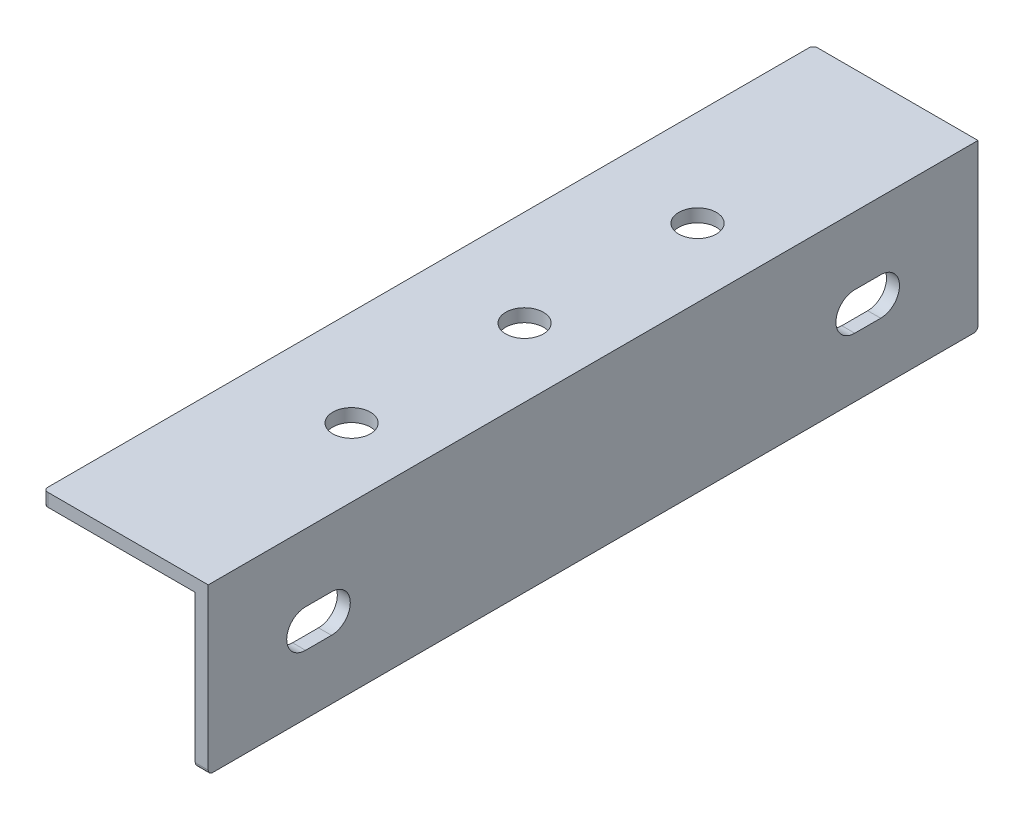
ISO-10303-21;
HEADER;
FILE_DESCRIPTION(('STEP AP214'),'2;1');
FILE_NAME('part.step','',(''),(''),'','','');
FILE_SCHEMA(('AUTOMOTIVE_DESIGN { 1 0 10303 214 1 1 1 1 }'));
ENDSEC;
DATA;
#1=APPLICATION_CONTEXT('core data for automotive mechanical design processes');
#2=APPLICATION_PROTOCOL_DEFINITION('international standard','automotive_design',2000,#1);
#3=PRODUCT_CONTEXT('',#1,'mechanical');
#4=PRODUCT('Part','Part','',(#3));
#5=PRODUCT_RELATED_PRODUCT_CATEGORY('part','',(#4));
#6=PRODUCT_DEFINITION_FORMATION('','',#4);
#7=PRODUCT_DEFINITION_CONTEXT('part definition',#1,'design');
#8=PRODUCT_DEFINITION('design','',#6,#7);
#9=PRODUCT_DEFINITION_SHAPE('','',#8);
#10=(LENGTH_UNIT() NAMED_UNIT(*) SI_UNIT(.MILLI.,.METRE.));
#11=(NAMED_UNIT(*) PLANE_ANGLE_UNIT() SI_UNIT($,.RADIAN.));
#12=(NAMED_UNIT(*) SI_UNIT($,.STERADIAN.) SOLID_ANGLE_UNIT());
#13=UNCERTAINTY_MEASURE_WITH_UNIT(LENGTH_MEASURE(1.E-05),#10,'distance_accuracy_value','');
#14=(GEOMETRIC_REPRESENTATION_CONTEXT(3) GLOBAL_UNCERTAINTY_ASSIGNED_CONTEXT((#13)) GLOBAL_UNIT_ASSIGNED_CONTEXT((#10,
#11,#12)) REPRESENTATION_CONTEXT('',''));
#15=CARTESIAN_POINT('',(0.,0.,0.));
#16=DIRECTION('',(0.,0.,1.));
#17=DIRECTION('',(1.,0.,0.));
#18=AXIS2_PLACEMENT_3D('',#15,#16,#17);
#19=CARTESIAN_POINT('',(9.662479411371,-18.55,-44.));
#20=DIRECTION('',(-1.,0.,0.));
#21=DIRECTION('',(0.,0.,1.));
#22=AXIS2_PLACEMENT_3D('',#19,#20,#21);
#23=CYLINDRICAL_SURFACE('',#22,0.5);
#24=CARTESIAN_POINT('',(8.025,-18.55,-44.));
#25=DIRECTION('',(-1.,0.,0.));
#26=DIRECTION('',(0.,0.,1.));
#27=AXIS2_PLACEMENT_3D('',#24,#25,#26);
#28=CIRCLE('',#27,0.5);
#29=CARTESIAN_POINT('',(8.025,-18.55,-44.5));
#30=VERTEX_POINT('',#29);
#31=CARTESIAN_POINT('',(8.025,-19.05,-44.));
#32=VERTEX_POINT('',#31);
#33=EDGE_CURVE('E224',#30,#32,#28,.T.);
#34=ORIENTED_EDGE('',*,*,#33,.F.);
#35=DIRECTION('',(-1.,0.,0.));
#36=VECTOR('',#35,1.);
#37=CARTESIAN_POINT('',(-9.525,-18.55,-44.5));
#38=LINE('',#37,#36);
#39=CARTESIAN_POINT('',(9.525,-18.55,-44.5));
#40=VERTEX_POINT('',#39);
#41=EDGE_CURVE('E177',#40,#30,#38,.T.);
#42=ORIENTED_EDGE('',*,*,#41,.F.);
#43=CARTESIAN_POINT('',(9.525,-18.55,-44.));
#44=DIRECTION('',(-1.,0.,0.));
#45=DIRECTION('',(0.,0.,1.));
#46=AXIS2_PLACEMENT_3D('',#43,#44,#45);
#47=CIRCLE('',#46,0.5);
#48=CARTESIAN_POINT('',(9.525,-19.05,-44.));
#49=VERTEX_POINT('',#48);
#50=EDGE_CURVE('E19',#40,#49,#47,.T.);
#51=ORIENTED_EDGE('',*,*,#50,.T.);
#52=DIRECTION('',(1.,0.,0.));
#53=VECTOR('',#52,1.);
#54=CARTESIAN_POINT('',(8.025,-19.05,-44.));
#55=LINE('',#54,#53);
#56=EDGE_CURVE('E240',#32,#49,#55,.T.);
#57=ORIENTED_EDGE('',*,*,#56,.F.);
#58=EDGE_LOOP('',(#34,#42,#51,#57));
#59=FACE_BOUND('',#58,.T.);
#60=ADVANCED_FACE('F16',(#59),#23,.T.);
#61=CARTESIAN_POINT('',(-9.025,-1.714615615478,-44.));
#62=DIRECTION('',(0.,1.,0.));
#63=DIRECTION('',(0.,0.,1.));
#64=AXIS2_PLACEMENT_3D('',#61,#62,#63);
#65=CYLINDRICAL_SURFACE('',#64,0.5);
#66=CARTESIAN_POINT('',(-9.025,0.,-44.));
#67=DIRECTION('',(0.,1.,0.));
#68=DIRECTION('',(0.,0.,1.));
#69=AXIS2_PLACEMENT_3D('',#66,#67,#68);
#70=CIRCLE('',#69,0.5);
#71=CARTESIAN_POINT('',(-9.525,0.,-44.));
#72=VERTEX_POINT('',#71);
#73=CARTESIAN_POINT('',(-9.025,0.,-44.5));
#74=VERTEX_POINT('',#73);
#75=EDGE_CURVE('E241',#72,#74,#70,.F.);
#76=ORIENTED_EDGE('',*,*,#75,.T.);
#77=DIRECTION('',(0.,1.,0.));
#78=VECTOR('',#77,1.);
#79=CARTESIAN_POINT('',(-9.025,0.,-44.5));
#80=LINE('',#79,#78);
#81=CARTESIAN_POINT('',(-9.025,-1.5,-44.5));
#82=VERTEX_POINT('',#81);
#83=EDGE_CURVE('E164',#82,#74,#80,.T.);
#84=ORIENTED_EDGE('',*,*,#83,.F.);
#85=CARTESIAN_POINT('',(-9.025,-1.5,-44.));
#86=DIRECTION('',(0.,1.,0.));
#87=DIRECTION('',(0.,0.,1.));
#88=AXIS2_PLACEMENT_3D('',#85,#86,#87);
#89=CIRCLE('',#88,0.5);
#90=CARTESIAN_POINT('',(-9.525,-1.5,-44.));
#91=VERTEX_POINT('',#90);
#92=EDGE_CURVE('E161',#91,#82,#89,.F.);
#93=ORIENTED_EDGE('',*,*,#92,.F.);
#94=DIRECTION('',(0.,1.,0.));
#95=VECTOR('',#94,1.);
#96=CARTESIAN_POINT('',(-9.525,0.,-44.));
#97=LINE('',#96,#95);
#98=EDGE_CURVE('E148',#72,#91,#97,.F.);
#99=ORIENTED_EDGE('',*,*,#98,.F.);
#100=EDGE_LOOP('',(#76,#84,#93,#99));
#101=FACE_BOUND('',#100,.T.);
#102=ADVANCED_FACE('F162',(#101),#65,.T.);
#103=CARTESIAN_POINT('',(8.025,-10.,30.25));
#104=DIRECTION('',(-1.,0.,0.));
#105=DIRECTION('',(0.,0.,1.));
#106=AXIS2_PLACEMENT_3D('',#103,#104,#105);
#107=CYLINDRICAL_SURFACE('',#106,2.175);
#108=DIRECTION('',(1.,0.,0.));
#109=VECTOR('',#108,1.);
#110=CARTESIAN_POINT('',(8.025,-12.175,30.25));
#111=LINE('',#110,#109);
#112=CARTESIAN_POINT('',(8.025,-12.175,30.25));
#113=VERTEX_POINT('',#112);
#114=CARTESIAN_POINT('',(9.525,-12.175,30.25));
#115=VERTEX_POINT('',#114);
#116=EDGE_CURVE('E242',#113,#115,#111,.T.);
#117=ORIENTED_EDGE('',*,*,#116,.T.);
#118=CARTESIAN_POINT('',(9.525,-10.,30.25));
#119=DIRECTION('',(-1.,0.,0.));
#120=DIRECTION('',(0.,0.,1.));
#121=AXIS2_PLACEMENT_3D('',#118,#119,#120);
#122=CIRCLE('',#121,2.175);
#123=CARTESIAN_POINT('',(9.525,-7.825,30.25));
#124=VERTEX_POINT('',#123);
#125=EDGE_CURVE('E209',#124,#115,#122,.T.);
#126=ORIENTED_EDGE('',*,*,#125,.F.);
#127=DIRECTION('',(1.,0.,0.));
#128=VECTOR('',#127,1.);
#129=CARTESIAN_POINT('',(8.025,-7.825,30.25));
#130=LINE('',#129,#128);
#131=CARTESIAN_POINT('',(8.025,-7.825,30.25));
#132=VERTEX_POINT('',#131);
#133=EDGE_CURVE('E282',#124,#132,#130,.F.);
#134=ORIENTED_EDGE('',*,*,#133,.T.);
#135=CARTESIAN_POINT('',(8.025,-10.,30.25));
#136=DIRECTION('',(-1.,0.,0.));
#137=DIRECTION('',(0.,0.,1.));
#138=AXIS2_PLACEMENT_3D('',#135,#136,#137);
#139=CIRCLE('',#138,2.175);
#140=EDGE_CURVE('E234',#113,#132,#139,.F.);
#141=ORIENTED_EDGE('',*,*,#140,.F.);
#142=EDGE_LOOP('',(#117,#126,#134,#141));
#143=FACE_BOUND('',#142,.T.);
#144=ADVANCED_FACE('F286',(#143),#107,.F.);
#145=CARTESIAN_POINT('',(8.025,-12.175,30.25));
#146=DIRECTION('',(0.,-1.,0.));
#147=DIRECTION('',(0.,0.,-1.));
#148=AXIS2_PLACEMENT_3D('',#145,#146,#147);
#149=PLANE('',#148);
#150=DIRECTION('',(-1.,0.,0.));
#151=VECTOR('',#150,1.);
#152=CARTESIAN_POINT('',(8.025,-12.175,33.25));
#153=LINE('',#152,#151);
#154=CARTESIAN_POINT('',(8.025,-12.175,33.25));
#155=VERTEX_POINT('',#154);
#156=CARTESIAN_POINT('',(9.525,-12.175,33.25));
#157=VERTEX_POINT('',#156);
#158=EDGE_CURVE('E244',#155,#157,#153,.F.);
#159=ORIENTED_EDGE('',*,*,#158,.T.);
#160=DIRECTION('',(0.,0.,-1.));
#161=VECTOR('',#160,1.);
#162=CARTESIAN_POINT('',(9.525,-12.175,-44.5));
#163=LINE('',#162,#161);
#164=EDGE_CURVE('E208',#115,#157,#163,.F.);
#165=ORIENTED_EDGE('',*,*,#164,.F.);
#166=ORIENTED_EDGE('',*,*,#116,.F.);
#167=DIRECTION('',(0.,0.,1.));
#168=VECTOR('',#167,1.);
#169=CARTESIAN_POINT('',(8.025,-12.175,-44.5));
#170=LINE('',#169,#168);
#171=EDGE_CURVE('E237',#155,#113,#170,.F.);
#172=ORIENTED_EDGE('',*,*,#171,.F.);
#173=EDGE_LOOP('',(#159,#165,#166,#172));
#174=FACE_BOUND('',#173,.T.);
#175=ADVANCED_FACE('F302',(#174),#149,.F.);
#176=CARTESIAN_POINT('',(8.025,-10.,33.25));
#177=DIRECTION('',(-1.,0.,0.));
#178=DIRECTION('',(0.,0.,1.));
#179=AXIS2_PLACEMENT_3D('',#176,#177,#178);
#180=CYLINDRICAL_SURFACE('',#179,2.175);
#181=CARTESIAN_POINT('',(9.525,-10.,33.25));
#182=DIRECTION('',(-1.,0.,0.));
#183=DIRECTION('',(0.,0.,1.));
#184=AXIS2_PLACEMENT_3D('',#181,#182,#183);
#185=CIRCLE('',#184,2.175);
#186=CARTESIAN_POINT('',(9.525,-7.825,33.25));
#187=VERTEX_POINT('',#186);
#188=EDGE_CURVE('E205',#157,#187,#185,.T.);
#189=ORIENTED_EDGE('',*,*,#188,.F.);
#190=ORIENTED_EDGE('',*,*,#158,.F.);
#191=CARTESIAN_POINT('',(8.025,-10.,33.25));
#192=DIRECTION('',(-1.,0.,0.));
#193=DIRECTION('',(0.,0.,1.));
#194=AXIS2_PLACEMENT_3D('',#191,#192,#193);
#195=CIRCLE('',#194,2.175);
#196=CARTESIAN_POINT('',(8.025,-7.825,33.25));
#197=VERTEX_POINT('',#196);
#198=EDGE_CURVE('E238',#197,#155,#195,.F.);
#199=ORIENTED_EDGE('',*,*,#198,.F.);
#200=DIRECTION('',(1.,0.,0.));
#201=VECTOR('',#200,1.);
#202=CARTESIAN_POINT('',(8.025,-7.825,33.25));
#203=LINE('',#202,#201);
#204=EDGE_CURVE('E251',#197,#187,#203,.T.);
#205=ORIENTED_EDGE('',*,*,#204,.T.);
#206=EDGE_LOOP('',(#189,#190,#199,#205));
#207=FACE_BOUND('',#206,.T.);
#208=ADVANCED_FACE('F503',(#207),#180,.F.);
#209=CARTESIAN_POINT('',(8.025,-7.825,33.25));
#210=DIRECTION('',(0.,1.,0.));
#211=DIRECTION('',(0.,0.,1.));
#212=AXIS2_PLACEMENT_3D('',#209,#210,#211);
#213=PLANE('',#212);
#214=ORIENTED_EDGE('',*,*,#133,.F.);
#215=DIRECTION('',(0.,0.,-1.));
#216=VECTOR('',#215,1.);
#217=CARTESIAN_POINT('',(9.525,-7.825,-44.5));
#218=LINE('',#217,#216);
#219=EDGE_CURVE('E207',#187,#124,#218,.T.);
#220=ORIENTED_EDGE('',*,*,#219,.F.);
#221=ORIENTED_EDGE('',*,*,#204,.F.);
#222=DIRECTION('',(0.,0.,1.));
#223=VECTOR('',#222,1.);
#224=CARTESIAN_POINT('',(8.025,-7.825,-44.5));
#225=LINE('',#224,#223);
#226=EDGE_CURVE('E236',#132,#197,#225,.T.);
#227=ORIENTED_EDGE('',*,*,#226,.F.);
#228=EDGE_LOOP('',(#214,#220,#221,#227));
#229=FACE_BOUND('',#228,.T.);
#230=ADVANCED_FACE('F292',(#229),#213,.F.);
#231=CARTESIAN_POINT('',(8.025,-12.175,-33.25));
#232=DIRECTION('',(0.,-1.,0.));
#233=DIRECTION('',(0.,0.,-1.));
#234=AXIS2_PLACEMENT_3D('',#231,#232,#233);
#235=PLANE('',#234);
#236=DIRECTION('',(-1.,0.,0.));
#237=VECTOR('',#236,1.);
#238=CARTESIAN_POINT('',(8.025,-12.175,-30.25));
#239=LINE('',#238,#237);
#240=CARTESIAN_POINT('',(8.025,-12.175,-30.25));
#241=VERTEX_POINT('',#240);
#242=CARTESIAN_POINT('',(9.525,-12.175,-30.25));
#243=VERTEX_POINT('',#242);
#244=EDGE_CURVE('E279',#241,#243,#239,.F.);
#245=ORIENTED_EDGE('',*,*,#244,.T.);
#246=DIRECTION('',(0.,0.,-1.));
#247=VECTOR('',#246,1.);
#248=CARTESIAN_POINT('',(9.525,-12.175,-44.5));
#249=LINE('',#248,#247);
#250=CARTESIAN_POINT('',(9.525,-12.175,-33.25));
#251=VERTEX_POINT('',#250);
#252=EDGE_CURVE('E204',#251,#243,#249,.F.);
#253=ORIENTED_EDGE('',*,*,#252,.F.);
#254=DIRECTION('',(-1.,0.,0.));
#255=VECTOR('',#254,1.);
#256=CARTESIAN_POINT('',(8.025,-12.175,-33.25));
#257=LINE('',#256,#255);
#258=CARTESIAN_POINT('',(8.025,-12.175,-33.25));
#259=VERTEX_POINT('',#258);
#260=EDGE_CURVE('E270',#251,#259,#257,.T.);
#261=ORIENTED_EDGE('',*,*,#260,.T.);
#262=DIRECTION('',(0.,0.,1.));
#263=VECTOR('',#262,1.);
#264=CARTESIAN_POINT('',(8.025,-12.175,-44.5));
#265=LINE('',#264,#263);
#266=EDGE_CURVE('E229',#241,#259,#265,.F.);
#267=ORIENTED_EDGE('',*,*,#266,.F.);
#268=EDGE_LOOP('',(#245,#253,#261,#267));
#269=FACE_BOUND('',#268,.T.);
#270=ADVANCED_FACE('F331',(#269),#235,.F.);
#271=CARTESIAN_POINT('',(8.025,-10.,-30.25));
#272=DIRECTION('',(-1.,0.,0.));
#273=DIRECTION('',(0.,0.,1.));
#274=AXIS2_PLACEMENT_3D('',#271,#272,#273);
#275=CYLINDRICAL_SURFACE('',#274,2.175);
#276=CARTESIAN_POINT('',(9.525,-10.,-30.25));
#277=DIRECTION('',(-1.,0.,0.));
#278=DIRECTION('',(0.,0.,1.));
#279=AXIS2_PLACEMENT_3D('',#276,#277,#278);
#280=CIRCLE('',#279,2.175);
#281=CARTESIAN_POINT('',(9.525,-7.825,-30.25));
#282=VERTEX_POINT('',#281);
#283=EDGE_CURVE('E202',#243,#282,#280,.T.);
#284=ORIENTED_EDGE('',*,*,#283,.F.);
#285=ORIENTED_EDGE('',*,*,#244,.F.);
#286=CARTESIAN_POINT('',(8.025,-10.,-30.25));
#287=DIRECTION('',(-1.,0.,0.));
#288=DIRECTION('',(0.,0.,1.));
#289=AXIS2_PLACEMENT_3D('',#286,#287,#288);
#290=CIRCLE('',#289,2.175);
#291=CARTESIAN_POINT('',(8.025,-7.825,-30.25));
#292=VERTEX_POINT('',#291);
#293=EDGE_CURVE('E230',#292,#241,#290,.F.);
#294=ORIENTED_EDGE('',*,*,#293,.F.);
#295=DIRECTION('',(1.,0.,0.));
#296=VECTOR('',#295,1.);
#297=CARTESIAN_POINT('',(8.025,-7.825,-30.25));
#298=LINE('',#297,#296);
#299=EDGE_CURVE('E274',#292,#282,#298,.T.);
#300=ORIENTED_EDGE('',*,*,#299,.T.);
#301=EDGE_LOOP('',(#284,#285,#294,#300));
#302=FACE_BOUND('',#301,.T.);
#303=ADVANCED_FACE('F341',(#302),#275,.F.);
#304=CARTESIAN_POINT('',(8.025,-7.825,-30.25));
#305=DIRECTION('',(0.,1.,0.));
#306=DIRECTION('',(0.,0.,1.));
#307=AXIS2_PLACEMENT_3D('',#304,#305,#306);
#308=PLANE('',#307);
#309=DIRECTION('',(-1.,0.,0.));
#310=VECTOR('',#309,1.);
#311=CARTESIAN_POINT('',(8.025,-7.825,-33.25));
#312=LINE('',#311,#310);
#313=CARTESIAN_POINT('',(8.025,-7.825,-33.25));
#314=VERTEX_POINT('',#313);
#315=CARTESIAN_POINT('',(9.525,-7.825,-33.25));
#316=VERTEX_POINT('',#315);
#317=EDGE_CURVE('E271',#314,#316,#312,.F.);
#318=ORIENTED_EDGE('',*,*,#317,.T.);
#319=DIRECTION('',(0.,0.,-1.));
#320=VECTOR('',#319,1.);
#321=CARTESIAN_POINT('',(9.525,-7.825,-44.5));
#322=LINE('',#321,#320);
#323=EDGE_CURVE('E201',#282,#316,#322,.T.);
#324=ORIENTED_EDGE('',*,*,#323,.F.);
#325=ORIENTED_EDGE('',*,*,#299,.F.);
#326=DIRECTION('',(0.,0.,1.));
#327=VECTOR('',#326,1.);
#328=CARTESIAN_POINT('',(8.025,-7.825,-44.5));
#329=LINE('',#328,#327);
#330=EDGE_CURVE('E233',#314,#292,#329,.T.);
#331=ORIENTED_EDGE('',*,*,#330,.F.);
#332=EDGE_LOOP('',(#318,#324,#325,#331));
#333=FACE_BOUND('',#332,.T.);
#334=ADVANCED_FACE('F338',(#333),#308,.F.);
#335=CARTESIAN_POINT('',(8.025,-10.,-33.25));
#336=DIRECTION('',(-1.,0.,0.));
#337=DIRECTION('',(0.,0.,1.));
#338=AXIS2_PLACEMENT_3D('',#335,#336,#337);
#339=CYLINDRICAL_SURFACE('',#338,2.175);
#340=ORIENTED_EDGE('',*,*,#260,.F.);
#341=CARTESIAN_POINT('',(9.525,-10.,-33.25));
#342=DIRECTION('',(-1.,0.,0.));
#343=DIRECTION('',(0.,0.,1.));
#344=AXIS2_PLACEMENT_3D('',#341,#342,#343);
#345=CIRCLE('',#344,2.175);
#346=EDGE_CURVE('E197',#316,#251,#345,.T.);
#347=ORIENTED_EDGE('',*,*,#346,.F.);
#348=ORIENTED_EDGE('',*,*,#317,.F.);
#349=CARTESIAN_POINT('',(8.025,-10.,-33.25));
#350=DIRECTION('',(-1.,0.,0.));
#351=DIRECTION('',(0.,0.,1.));
#352=AXIS2_PLACEMENT_3D('',#349,#350,#351);
#353=CIRCLE('',#352,2.175);
#354=EDGE_CURVE('E226',#259,#314,#353,.F.);
#355=ORIENTED_EDGE('',*,*,#354,.F.);
#356=EDGE_LOOP('',(#340,#347,#348,#355));
#357=FACE_BOUND('',#356,.T.);
#358=ADVANCED_FACE('F335',(#357),#339,.F.);
#359=CARTESIAN_POINT('',(8.025,-19.05,-44.5));
#360=DIRECTION('',(0.,-1.,0.));
#361=DIRECTION('',(0.,0.,-1.));
#362=AXIS2_PLACEMENT_3D('',#359,#360,#361);
#363=PLANE('',#362);
#364=DIRECTION('',(0.,0.,-1.));
#365=VECTOR('',#364,1.);
#366=CARTESIAN_POINT('',(9.525,-19.05,-44.5));
#367=LINE('',#366,#365);
#368=CARTESIAN_POINT('',(9.525,-19.05,44.));
#369=VERTEX_POINT('',#368);
#370=EDGE_CURVE('E200',#369,#49,#367,.T.);
#371=ORIENTED_EDGE('',*,*,#370,.F.);
#372=DIRECTION('',(1.,0.,0.));
#373=VECTOR('',#372,1.);
#374=CARTESIAN_POINT('',(7.882019626873,-19.05,44.));
#375=LINE('',#374,#373);
#376=CARTESIAN_POINT('',(8.025,-19.05,44.));
#377=VERTEX_POINT('',#376);
#378=EDGE_CURVE('E112',#377,#369,#375,.T.);
#379=ORIENTED_EDGE('',*,*,#378,.F.);
#380=DIRECTION('',(0.,0.,1.));
#381=VECTOR('',#380,1.);
#382=CARTESIAN_POINT('',(8.025,-19.05,-44.5));
#383=LINE('',#382,#381);
#384=EDGE_CURVE('E223',#32,#377,#383,.T.);
#385=ORIENTED_EDGE('',*,*,#384,.F.);
#386=ORIENTED_EDGE('',*,*,#56,.T.);
#387=EDGE_LOOP('',(#371,#379,#385,#386));
#388=FACE_BOUND('',#387,.T.);
#389=ADVANCED_FACE('F389',(#388),#363,.T.);
#390=CARTESIAN_POINT('',(8.025,-1.5,-44.5));
#391=DIRECTION('',(-1.,0.,0.));
#392=DIRECTION('',(0.,0.,1.));
#393=AXIS2_PLACEMENT_3D('',#390,#391,#392);
#394=PLANE('',#393);
#395=DIRECTION('',(0.,1.,0.));
#396=VECTOR('',#395,1.);
#397=CARTESIAN_POINT('',(8.025,0.,44.5));
#398=LINE('',#397,#396);
#399=CARTESIAN_POINT('',(8.025,-1.5,44.5));
#400=VERTEX_POINT('',#399);
#401=CARTESIAN_POINT('',(8.025,-18.55,44.5));
#402=VERTEX_POINT('',#401);
#403=EDGE_CURVE('E195',#400,#402,#398,.F.);
#404=ORIENTED_EDGE('',*,*,#403,.F.);
#405=DIRECTION('',(0.,0.,-1.));
#406=VECTOR('',#405,1.);
#407=CARTESIAN_POINT('',(8.025,-1.5,0.));
#408=LINE('',#407,#406);
#409=CARTESIAN_POINT('',(8.025,-1.5,-44.5));
#410=VERTEX_POINT('',#409);
#411=EDGE_CURVE('E168',#410,#400,#408,.F.);
#412=ORIENTED_EDGE('',*,*,#411,.F.);
#413=DIRECTION('',(0.,1.,0.));
#414=VECTOR('',#413,1.);
#415=CARTESIAN_POINT('',(8.025,0.,-44.5));
#416=LINE('',#415,#414);
#417=EDGE_CURVE('E257',#30,#410,#416,.T.);
#418=ORIENTED_EDGE('',*,*,#417,.F.);
#419=ORIENTED_EDGE('',*,*,#33,.T.);
#420=ORIENTED_EDGE('',*,*,#384,.T.);
#421=CARTESIAN_POINT('',(8.025,-18.55,44.));
#422=DIRECTION('',(1.,0.,0.));
#423=DIRECTION('',(0.,0.,-1.));
#424=AXIS2_PLACEMENT_3D('',#421,#422,#423);
#425=CIRCLE('',#424,0.5);
#426=EDGE_CURVE('E221',#402,#377,#425,.T.);
#427=ORIENTED_EDGE('',*,*,#426,.F.);
#428=EDGE_LOOP('',(#404,#412,#418,#419,#420,#427));
#429=FACE_BOUND('',#428,.T.);
#430=ORIENTED_EDGE('',*,*,#266,.T.);
#431=ORIENTED_EDGE('',*,*,#354,.T.);
#432=ORIENTED_EDGE('',*,*,#330,.T.);
#433=ORIENTED_EDGE('',*,*,#293,.T.);
#434=EDGE_LOOP('',(#430,#431,#432,#433));
#435=FACE_BOUND('',#434,.T.);
#436=ORIENTED_EDGE('',*,*,#140,.T.);
#437=ORIENTED_EDGE('',*,*,#226,.T.);
#438=ORIENTED_EDGE('',*,*,#198,.T.);
#439=ORIENTED_EDGE('',*,*,#171,.T.);
#440=EDGE_LOOP('',(#436,#437,#438,#439));
#441=FACE_BOUND('',#440,.T.);
#442=ADVANCED_FACE('F300',(#429,#435,#441),#394,.T.);
#443=CARTESIAN_POINT('',(7.882019626873,-18.55,44.));
#444=DIRECTION('',(1.,0.,0.));
#445=DIRECTION('',(0.,0.,-1.));
#446=AXIS2_PLACEMENT_3D('',#443,#444,#445);
#447=CYLINDRICAL_SURFACE('',#446,0.5);
#448=CARTESIAN_POINT('',(9.525,-18.55,44.));
#449=DIRECTION('',(1.,0.,0.));
#450=DIRECTION('',(0.,0.,-1.));
#451=AXIS2_PLACEMENT_3D('',#448,#449,#450);
#452=CIRCLE('',#451,0.5);
#453=CARTESIAN_POINT('',(9.525,-18.55,44.5));
#454=VERTEX_POINT('',#453);
#455=EDGE_CURVE('E193',#454,#369,#452,.T.);
#456=ORIENTED_EDGE('',*,*,#455,.F.);
#457=DIRECTION('',(1.,0.,0.));
#458=VECTOR('',#457,1.);
#459=CARTESIAN_POINT('',(9.525,-18.55,44.5));
#460=LINE('',#459,#458);
#461=EDGE_CURVE('E319',#402,#454,#460,.T.);
#462=ORIENTED_EDGE('',*,*,#461,.F.);
#463=ORIENTED_EDGE('',*,*,#426,.T.);
#464=ORIENTED_EDGE('',*,*,#378,.T.);
#465=EDGE_LOOP('',(#456,#462,#463,#464));
#466=FACE_BOUND('',#465,.T.);
#467=ADVANCED_FACE('F378',(#466),#447,.T.);
#468=CARTESIAN_POINT('',(-9.025,-1.645502112188,44.));
#469=DIRECTION('',(0.,1.,0.));
#470=DIRECTION('',(0.,0.,1.));
#471=AXIS2_PLACEMENT_3D('',#468,#469,#470);
#472=CYLINDRICAL_SURFACE('',#471,0.5);
#473=CARTESIAN_POINT('',(-9.025,0.,44.));
#474=DIRECTION('',(0.,1.,0.));
#475=DIRECTION('',(0.,0.,1.));
#476=AXIS2_PLACEMENT_3D('',#473,#474,#475);
#477=CIRCLE('',#476,0.5);
#478=CARTESIAN_POINT('',(-9.025,0.,44.5));
#479=VERTEX_POINT('',#478);
#480=CARTESIAN_POINT('',(-9.525,0.,44.));
#481=VERTEX_POINT('',#480);
#482=EDGE_CURVE('E34',#479,#481,#477,.F.);
#483=ORIENTED_EDGE('',*,*,#482,.T.);
#484=DIRECTION('',(0.,1.,0.));
#485=VECTOR('',#484,1.);
#486=CARTESIAN_POINT('',(-9.525,0.,44.));
#487=LINE('',#486,#485);
#488=CARTESIAN_POINT('',(-9.525,-1.5,44.));
#489=VERTEX_POINT('',#488);
#490=EDGE_CURVE('E175',#489,#481,#487,.T.);
#491=ORIENTED_EDGE('',*,*,#490,.F.);
#492=CARTESIAN_POINT('',(-9.025,-1.5,44.));
#493=DIRECTION('',(0.,1.,0.));
#494=DIRECTION('',(0.,0.,1.));
#495=AXIS2_PLACEMENT_3D('',#492,#493,#494);
#496=CIRCLE('',#495,0.5);
#497=CARTESIAN_POINT('',(-9.025,-1.5,44.5));
#498=VERTEX_POINT('',#497);
#499=EDGE_CURVE('E174',#498,#489,#496,.F.);
#500=ORIENTED_EDGE('',*,*,#499,.F.);
#501=DIRECTION('',(0.,1.,0.));
#502=VECTOR('',#501,1.);
#503=CARTESIAN_POINT('',(-9.025,0.,44.5));
#504=LINE('',#503,#502);
#505=EDGE_CURVE('E312',#479,#498,#504,.F.);
#506=ORIENTED_EDGE('',*,*,#505,.F.);
#507=EDGE_LOOP('',(#483,#491,#500,#506));
#508=FACE_BOUND('',#507,.T.);
#509=ADVANCED_FACE('F380',(#508),#472,.T.);
#510=CARTESIAN_POINT('',(0.,-1.5,0.));
#511=DIRECTION('',(0.,-1.,0.));
#512=DIRECTION('',(0.,0.,-1.));
#513=AXIS2_PLACEMENT_3D('',#510,#511,#512);
#514=PLANE('',#513);
#515=DIRECTION('',(1.,0.,0.));
#516=VECTOR('',#515,1.);
#517=CARTESIAN_POINT('',(9.525,-1.5,44.5));
#518=LINE('',#517,#516);
#519=EDGE_CURVE('E192',#498,#400,#518,.T.);
#520=ORIENTED_EDGE('',*,*,#519,.F.);
#521=ORIENTED_EDGE('',*,*,#499,.T.);
#522=DIRECTION('',(0.,0.,1.));
#523=VECTOR('',#522,1.);
#524=CARTESIAN_POINT('',(-9.525,-1.5,44.5));
#525=LINE('',#524,#523);
#526=EDGE_CURVE('E153',#91,#489,#525,.T.);
#527=ORIENTED_EDGE('',*,*,#526,.F.);
#528=ORIENTED_EDGE('',*,*,#92,.T.);
#529=DIRECTION('',(-1.,0.,0.));
#530=VECTOR('',#529,1.);
#531=CARTESIAN_POINT('',(-9.525,-1.5,-44.5));
#532=LINE('',#531,#530);
#533=EDGE_CURVE('E255',#410,#82,#532,.T.);
#534=ORIENTED_EDGE('',*,*,#533,.F.);
#535=ORIENTED_EDGE('',*,*,#411,.T.);
#536=EDGE_LOOP('',(#520,#521,#527,#528,#534,#535));
#537=FACE_BOUND('',#536,.T.);
#538=CARTESIAN_POINT('',(1.6,-1.5,0.));
#539=DIRECTION('',(0.,1.,0.));
#540=DIRECTION('',(0.,0.,1.));
#541=AXIS2_PLACEMENT_3D('',#538,#539,#540);
#542=CIRCLE('',#541,2.175);
#543=CARTESIAN_POINT('',(1.6,-1.5,2.175));
#544=VERTEX_POINT('',#543);
#545=EDGE_CURVE('E157',#544,#544,#542,.T.);
#546=ORIENTED_EDGE('',*,*,#545,.T.);
#547=EDGE_LOOP('',(#546));
#548=FACE_BOUND('',#547,.T.);
#549=CARTESIAN_POINT('',(1.6,-1.5,20.));
#550=DIRECTION('',(0.,1.,0.));
#551=DIRECTION('',(0.,0.,1.));
#552=AXIS2_PLACEMENT_3D('',#549,#550,#551);
#553=CIRCLE('',#552,2.175);
#554=CARTESIAN_POINT('',(1.6,-1.5,22.175));
#555=VERTEX_POINT('',#554);
#556=EDGE_CURVE('E213',#555,#555,#553,.T.);
#557=ORIENTED_EDGE('',*,*,#556,.T.);
#558=EDGE_LOOP('',(#557));
#559=FACE_BOUND('',#558,.T.);
#560=CARTESIAN_POINT('',(1.6,-1.5,-20.));
#561=DIRECTION('',(0.,1.,0.));
#562=DIRECTION('',(0.,0.,1.));
#563=AXIS2_PLACEMENT_3D('',#560,#561,#562);
#564=CIRCLE('',#563,2.175);
#565=CARTESIAN_POINT('',(1.6,-1.5,-17.825));
#566=VERTEX_POINT('',#565);
#567=EDGE_CURVE('E216',#566,#566,#564,.T.);
#568=ORIENTED_EDGE('',*,*,#567,.T.);
#569=EDGE_LOOP('',(#568));
#570=FACE_BOUND('',#569,.T.);
#571=ADVANCED_FACE('F171',(#537,#548,#559,#570),#514,.T.);
#572=CARTESIAN_POINT('',(1.6,0.,-20.));
#573=DIRECTION('',(0.,1.,0.));
#574=DIRECTION('',(0.,0.,1.));
#575=AXIS2_PLACEMENT_3D('',#572,#573,#574);
#576=CYLINDRICAL_SURFACE('',#575,2.175);
#577=ORIENTED_EDGE('',*,*,#567,.F.);
#578=EDGE_LOOP('',(#577));
#579=FACE_BOUND('',#578,.T.);
#580=CARTESIAN_POINT('',(1.6,0.,-20.));
#581=DIRECTION('',(0.,1.,0.));
#582=DIRECTION('',(0.,0.,1.));
#583=AXIS2_PLACEMENT_3D('',#580,#581,#582);
#584=CIRCLE('',#583,2.175);
#585=CARTESIAN_POINT('',(1.6,0.,-17.825));
#586=VERTEX_POINT('',#585);
#587=EDGE_CURVE('E189',#586,#586,#584,.T.);
#588=ORIENTED_EDGE('',*,*,#587,.T.);
#589=EDGE_LOOP('',(#588));
#590=FACE_BOUND('',#589,.T.);
#591=ADVANCED_FACE('F412',(#579,#590),#576,.F.);
#592=CARTESIAN_POINT('',(1.6,0.,20.));
#593=DIRECTION('',(0.,1.,0.));
#594=DIRECTION('',(0.,0.,1.));
#595=AXIS2_PLACEMENT_3D('',#592,#593,#594);
#596=CYLINDRICAL_SURFACE('',#595,2.175);
#597=ORIENTED_EDGE('',*,*,#556,.F.);
#598=EDGE_LOOP('',(#597));
#599=FACE_BOUND('',#598,.T.);
#600=CARTESIAN_POINT('',(1.6,0.,20.));
#601=DIRECTION('',(0.,1.,0.));
#602=DIRECTION('',(0.,0.,1.));
#603=AXIS2_PLACEMENT_3D('',#600,#601,#602);
#604=CIRCLE('',#603,2.175);
#605=CARTESIAN_POINT('',(1.6,0.,22.175));
#606=VERTEX_POINT('',#605);
#607=EDGE_CURVE('E186',#606,#606,#604,.T.);
#608=ORIENTED_EDGE('',*,*,#607,.T.);
#609=EDGE_LOOP('',(#608));
#610=FACE_BOUND('',#609,.T.);
#611=ADVANCED_FACE('F408',(#599,#610),#596,.F.);
#612=CARTESIAN_POINT('',(1.6,0.,0.));
#613=DIRECTION('',(0.,1.,0.));
#614=DIRECTION('',(0.,0.,1.));
#615=AXIS2_PLACEMENT_3D('',#612,#613,#614);
#616=CYLINDRICAL_SURFACE('',#615,2.175);
#617=ORIENTED_EDGE('',*,*,#545,.F.);
#618=EDGE_LOOP('',(#617));
#619=FACE_BOUND('',#618,.T.);
#620=CARTESIAN_POINT('',(1.6,0.,0.));
#621=DIRECTION('',(0.,1.,0.));
#622=DIRECTION('',(0.,0.,1.));
#623=AXIS2_PLACEMENT_3D('',#620,#621,#622);
#624=CIRCLE('',#623,2.175);
#625=CARTESIAN_POINT('',(1.6,0.,2.175));
#626=VERTEX_POINT('',#625);
#627=EDGE_CURVE('E183',#626,#626,#624,.T.);
#628=ORIENTED_EDGE('',*,*,#627,.T.);
#629=EDGE_LOOP('',(#628));
#630=FACE_BOUND('',#629,.T.);
#631=ADVANCED_FACE('F405',(#619,#630),#616,.F.);
#632=CARTESIAN_POINT('',(-9.525,0.,44.5));
#633=DIRECTION('',(-1.,0.,0.));
#634=DIRECTION('',(0.,0.,1.));
#635=AXIS2_PLACEMENT_3D('',#632,#633,#634);
#636=PLANE('',#635);
#637=ORIENTED_EDGE('',*,*,#526,.T.);
#638=ORIENTED_EDGE('',*,*,#490,.T.);
#639=DIRECTION('',(0.,0.,-1.));
#640=VECTOR('',#639,1.);
#641=CARTESIAN_POINT('',(-9.525,0.,0.));
#642=LINE('',#641,#640);
#643=EDGE_CURVE('E155',#481,#72,#642,.T.);
#644=ORIENTED_EDGE('',*,*,#643,.T.);
#645=ORIENTED_EDGE('',*,*,#98,.T.);
#646=EDGE_LOOP('',(#637,#638,#644,#645));
#647=FACE_BOUND('',#646,.T.);
#648=ADVANCED_FACE('F150',(#647),#636,.T.);
#649=CARTESIAN_POINT('',(-9.525,0.,-44.5));
#650=DIRECTION('',(0.,0.,-1.));
#651=DIRECTION('',(-1.,0.,0.));
#652=AXIS2_PLACEMENT_3D('',#649,#650,#651);
#653=PLANE('',#652);
#654=ORIENTED_EDGE('',*,*,#83,.T.);
#655=DIRECTION('',(1.,0.,0.));
#656=VECTOR('',#655,1.);
#657=CARTESIAN_POINT('',(0.,0.,-44.5));
#658=LINE('',#657,#656);
#659=CARTESIAN_POINT('',(9.525,0.,-44.5));
#660=VERTEX_POINT('',#659);
#661=EDGE_CURVE('E354',#74,#660,#658,.T.);
#662=ORIENTED_EDGE('',*,*,#661,.T.);
#663=DIRECTION('',(0.,1.,0.));
#664=VECTOR('',#663,1.);
#665=CARTESIAN_POINT('',(9.525,0.,-44.5));
#666=LINE('',#665,#664);
#667=EDGE_CURVE('E196',#40,#660,#666,.T.);
#668=ORIENTED_EDGE('',*,*,#667,.F.);
#669=ORIENTED_EDGE('',*,*,#41,.T.);
#670=ORIENTED_EDGE('',*,*,#417,.T.);
#671=ORIENTED_EDGE('',*,*,#533,.T.);
#672=EDGE_LOOP('',(#654,#662,#668,#669,#670,#671));
#673=FACE_BOUND('',#672,.T.);
#674=ADVANCED_FACE('F366',(#673),#653,.T.);
#675=CARTESIAN_POINT('',(9.525,0.,-44.5));
#676=DIRECTION('',(1.,0.,0.));
#677=DIRECTION('',(0.,0.,-1.));
#678=AXIS2_PLACEMENT_3D('',#675,#676,#677);
#679=PLANE('',#678);
#680=DIRECTION('',(0.,1.,0.));
#681=VECTOR('',#680,1.);
#682=CARTESIAN_POINT('',(9.525,0.,44.5));
#683=LINE('',#682,#681);
#684=CARTESIAN_POINT('',(9.525,0.,44.5));
#685=VERTEX_POINT('',#684);
#686=EDGE_CURVE('E324',#454,#685,#683,.T.);
#687=ORIENTED_EDGE('',*,*,#686,.F.);
#688=ORIENTED_EDGE('',*,*,#455,.T.);
#689=ORIENTED_EDGE('',*,*,#370,.T.);
#690=ORIENTED_EDGE('',*,*,#50,.F.);
#691=ORIENTED_EDGE('',*,*,#667,.T.);
#692=DIRECTION('',(0.,0.,-1.));
#693=VECTOR('',#692,1.);
#694=CARTESIAN_POINT('',(9.525,0.,0.));
#695=LINE('',#694,#693);
#696=EDGE_CURVE('E25',#660,#685,#695,.F.);
#697=ORIENTED_EDGE('',*,*,#696,.T.);
#698=EDGE_LOOP('',(#687,#688,#689,#690,#691,#697));
#699=FACE_BOUND('',#698,.T.);
#700=ORIENTED_EDGE('',*,*,#323,.T.);
#701=ORIENTED_EDGE('',*,*,#346,.T.);
#702=ORIENTED_EDGE('',*,*,#252,.T.);
#703=ORIENTED_EDGE('',*,*,#283,.T.);
#704=EDGE_LOOP('',(#700,#701,#702,#703));
#705=FACE_BOUND('',#704,.T.);
#706=ORIENTED_EDGE('',*,*,#188,.T.);
#707=ORIENTED_EDGE('',*,*,#219,.T.);
#708=ORIENTED_EDGE('',*,*,#125,.T.);
#709=ORIENTED_EDGE('',*,*,#164,.T.);
#710=EDGE_LOOP('',(#706,#707,#708,#709));
#711=FACE_BOUND('',#710,.T.);
#712=ADVANCED_FACE('F343',(#699,#705,#711),#679,.T.);
#713=CARTESIAN_POINT('',(9.525,0.,44.5));
#714=DIRECTION('',(0.,0.,1.));
#715=DIRECTION('',(1.,0.,0.));
#716=AXIS2_PLACEMENT_3D('',#713,#714,#715);
#717=PLANE('',#716);
#718=ORIENTED_EDGE('',*,*,#505,.T.);
#719=ORIENTED_EDGE('',*,*,#519,.T.);
#720=ORIENTED_EDGE('',*,*,#403,.T.);
#721=ORIENTED_EDGE('',*,*,#461,.T.);
#722=ORIENTED_EDGE('',*,*,#686,.T.);
#723=DIRECTION('',(1.,0.,0.));
#724=VECTOR('',#723,1.);
#725=CARTESIAN_POINT('',(0.,0.,44.5));
#726=LINE('',#725,#724);
#727=EDGE_CURVE('E10',#685,#479,#726,.F.);
#728=ORIENTED_EDGE('',*,*,#727,.T.);
#729=EDGE_LOOP('',(#718,#719,#720,#721,#722,#728));
#730=FACE_BOUND('',#729,.T.);
#731=ADVANCED_FACE('F374',(#730),#717,.T.);
#732=CARTESIAN_POINT('',(0.,0.,0.));
#733=DIRECTION('',(0.,-1.,0.));
#734=DIRECTION('',(0.,0.,-1.));
#735=AXIS2_PLACEMENT_3D('',#732,#733,#734);
#736=PLANE('',#735);
#737=ORIENTED_EDGE('',*,*,#727,.F.);
#738=ORIENTED_EDGE('',*,*,#696,.F.);
#739=ORIENTED_EDGE('',*,*,#661,.F.);
#740=ORIENTED_EDGE('',*,*,#75,.F.);
#741=ORIENTED_EDGE('',*,*,#643,.F.);
#742=ORIENTED_EDGE('',*,*,#482,.F.);
#743=EDGE_LOOP('',(#737,#738,#739,#740,#741,#742));
#744=FACE_BOUND('',#743,.T.);
#745=ORIENTED_EDGE('',*,*,#627,.F.);
#746=EDGE_LOOP('',(#745));
#747=FACE_BOUND('',#746,.T.);
#748=ORIENTED_EDGE('',*,*,#607,.F.);
#749=EDGE_LOOP('',(#748));
#750=FACE_BOUND('',#749,.T.);
#751=ORIENTED_EDGE('',*,*,#587,.F.);
#752=EDGE_LOOP('',(#751));
#753=FACE_BOUND('',#752,.T.);
#754=ADVANCED_FACE('F369',(#744,#747,#750,#753),#736,.F.);
#755=CLOSED_SHELL('',(#60,#102,#144,#175,#208,#230,#270,#303,#334,#358,#389,#442,#467,#509,#571,
#591,#611,#631,#648,#674,#712,#731,#754));
#756=MANIFOLD_SOLID_BREP('B1',#755);
#757=ADVANCED_BREP_SHAPE_REPRESENTATION('',(#18,#756),#14);
#758=SHAPE_DEFINITION_REPRESENTATION(#9,#757);
ENDSEC;
END-ISO-10303-21;
